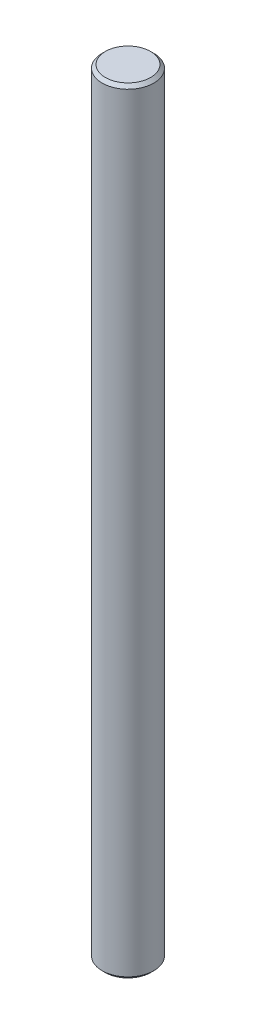
ISO-10303-21;
HEADER;
FILE_DESCRIPTION(('STEP AP214'),'2;1');
FILE_NAME('part.step','',(''),(''),'','','');
FILE_SCHEMA(('AUTOMOTIVE_DESIGN { 1 0 10303 214 1 1 1 1 }'));
ENDSEC;
DATA;
#1=APPLICATION_CONTEXT('core data for automotive mechanical design processes');
#2=APPLICATION_PROTOCOL_DEFINITION('international standard','automotive_design',2000,#1);
#3=PRODUCT_CONTEXT('',#1,'mechanical');
#4=PRODUCT('Part','Part','',(#3));
#5=PRODUCT_RELATED_PRODUCT_CATEGORY('part','',(#4));
#6=PRODUCT_DEFINITION_FORMATION('','',#4);
#7=PRODUCT_DEFINITION_CONTEXT('part definition',#1,'design');
#8=PRODUCT_DEFINITION('design','',#6,#7);
#9=PRODUCT_DEFINITION_SHAPE('','',#8);
#10=(LENGTH_UNIT() NAMED_UNIT(*) SI_UNIT(.MILLI.,.METRE.));
#11=(NAMED_UNIT(*) PLANE_ANGLE_UNIT() SI_UNIT($,.RADIAN.));
#12=(NAMED_UNIT(*) SI_UNIT($,.STERADIAN.) SOLID_ANGLE_UNIT());
#13=UNCERTAINTY_MEASURE_WITH_UNIT(LENGTH_MEASURE(1.E-05),#10,'distance_accuracy_value','');
#14=(GEOMETRIC_REPRESENTATION_CONTEXT(3) GLOBAL_UNCERTAINTY_ASSIGNED_CONTEXT((#13)) GLOBAL_UNIT_ASSIGNED_CONTEXT((#10,
#11,#12)) REPRESENTATION_CONTEXT('',''));
#15=CARTESIAN_POINT('',(0.,0.,0.));
#16=DIRECTION('',(0.,0.,1.));
#17=DIRECTION('',(1.,0.,0.));
#18=AXIS2_PLACEMENT_3D('',#15,#16,#17);
#19=CARTESIAN_POINT('',(0.,30.,0.));
#20=DIRECTION('',(0.,-1.,0.));
#21=DIRECTION('',(0.,0.,-1.));
#22=AXIS2_PLACEMENT_3D('',#19,#20,#21);
#23=CYLINDRICAL_SURFACE('',#22,2.);
#24=CARTESIAN_POINT('',(0.,-29.75,0.));
#25=DIRECTION('',(0.,1.,0.));
#26=DIRECTION('',(0.,0.,1.));
#27=AXIS2_PLACEMENT_3D('',#24,#25,#26);
#28=CIRCLE('',#27,2.);
#29=CARTESIAN_POINT('',(0.,-29.75,2.));
#30=VERTEX_POINT('',#29);
#31=EDGE_CURVE('E50',#30,#30,#28,.T.);
#32=ORIENTED_EDGE('',*,*,#31,.T.);
#33=EDGE_LOOP('',(#32));
#34=FACE_BOUND('',#33,.T.);
#35=CARTESIAN_POINT('',(0.,29.75,0.));
#36=DIRECTION('',(0.,1.,0.));
#37=DIRECTION('',(0.,0.,1.));
#38=AXIS2_PLACEMENT_3D('',#35,#36,#37);
#39=CIRCLE('',#38,2.);
#40=CARTESIAN_POINT('',(0.,29.75,2.));
#41=VERTEX_POINT('',#40);
#42=EDGE_CURVE('E54',#41,#41,#39,.F.);
#43=ORIENTED_EDGE('',*,*,#42,.T.);
#44=EDGE_LOOP('',(#43));
#45=FACE_BOUND('',#44,.T.);
#46=ADVANCED_FACE('F38',(#34,#45),#23,.T.);
#47=CARTESIAN_POINT('',(0.,30.,0.));
#48=DIRECTION('',(0.,1.,0.));
#49=DIRECTION('',(0.,0.,1.));
#50=AXIS2_PLACEMENT_3D('',#47,#48,#49);
#51=PLANE('',#50);
#52=CARTESIAN_POINT('',(0.,30.,0.));
#53=DIRECTION('',(0.,1.,0.));
#54=DIRECTION('',(0.,0.,1.));
#55=AXIS2_PLACEMENT_3D('',#52,#53,#54);
#56=CIRCLE('',#55,1.75000000000001);
#57=CARTESIAN_POINT('',(0.,30.,1.75000000000001));
#58=VERTEX_POINT('',#57);
#59=EDGE_CURVE('E10',#58,#58,#56,.T.);
#60=ORIENTED_EDGE('',*,*,#59,.T.);
#61=EDGE_LOOP('',(#60));
#62=FACE_BOUND('',#61,.T.);
#63=ADVANCED_FACE('F70',(#62),#51,.T.);
#64=CARTESIAN_POINT('',(0.,-30.,0.));
#65=DIRECTION('',(0.,1.,0.));
#66=DIRECTION('',(0.,0.,1.));
#67=AXIS2_PLACEMENT_3D('',#64,#65,#66);
#68=PLANE('',#67);
#69=CARTESIAN_POINT('',(0.,-30.,0.));
#70=DIRECTION('',(0.,1.,0.));
#71=DIRECTION('',(0.,0.,1.));
#72=AXIS2_PLACEMENT_3D('',#69,#70,#71);
#73=CIRCLE('',#72,1.75);
#74=CARTESIAN_POINT('',(0.,-30.,1.75));
#75=VERTEX_POINT('',#74);
#76=EDGE_CURVE('E46',#75,#75,#73,.F.);
#77=ORIENTED_EDGE('',*,*,#76,.T.);
#78=EDGE_LOOP('',(#77));
#79=FACE_BOUND('',#78,.T.);
#80=ADVANCED_FACE('F67',(#79),#68,.F.);
#81=CARTESIAN_POINT('',(0.,-29.75,0.));
#82=DIRECTION('',(0.,1.,0.));
#83=DIRECTION('',(0.,0.,1.));
#84=AXIS2_PLACEMENT_3D('',#81,#82,#83);
#85=CONICAL_SURFACE('',#84,2.,0.785398163397445);
#86=ORIENTED_EDGE('',*,*,#76,.F.);
#87=EDGE_LOOP('',(#86));
#88=FACE_BOUND('',#87,.T.);
#89=ORIENTED_EDGE('',*,*,#31,.F.);
#90=EDGE_LOOP('',(#89));
#91=FACE_BOUND('',#90,.T.);
#92=ADVANCED_FACE('F63',(#88,#91),#85,.T.);
#93=CARTESIAN_POINT('',(0.,30.,0.));
#94=DIRECTION('',(0.,-1.,0.));
#95=DIRECTION('',(0.,0.,-1.));
#96=AXIS2_PLACEMENT_3D('',#93,#94,#95);
#97=CONICAL_SURFACE('',#96,1.75000000000001,0.785398163397445);
#98=ORIENTED_EDGE('',*,*,#42,.F.);
#99=EDGE_LOOP('',(#98));
#100=FACE_BOUND('',#99,.T.);
#101=ORIENTED_EDGE('',*,*,#59,.F.);
#102=EDGE_LOOP('',(#101));
#103=FACE_BOUND('',#102,.T.);
#104=ADVANCED_FACE('F41',(#100,#103),#97,.T.);
#105=CLOSED_SHELL('',(#46,#63,#80,#92,#104));
#106=MANIFOLD_SOLID_BREP('B2',#105);
#107=ADVANCED_BREP_SHAPE_REPRESENTATION('',(#18,#106),#14);
#108=SHAPE_DEFINITION_REPRESENTATION(#9,#107);
ENDSEC;
END-ISO-10303-21;
